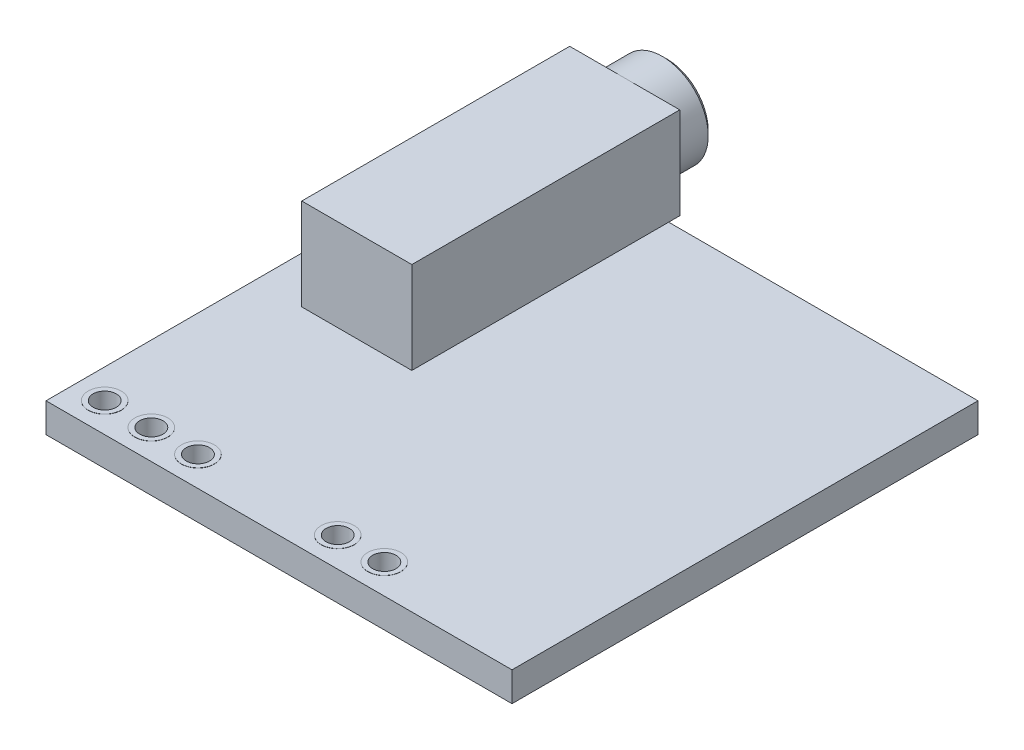
ISO-10303-21;
HEADER;
FILE_DESCRIPTION(('STEP AP214'),'2;1');
FILE_NAME('part.step','',(''),(''),'','','');
FILE_SCHEMA(('AUTOMOTIVE_DESIGN { 1 0 10303 214 1 1 1 1 }'));
ENDSEC;
DATA;
#1=APPLICATION_CONTEXT('core data for automotive mechanical design processes');
#2=APPLICATION_PROTOCOL_DEFINITION('international standard','automotive_design',2000,#1);
#3=PRODUCT_CONTEXT('',#1,'mechanical');
#4=PRODUCT('Part','Part','',(#3));
#5=PRODUCT_RELATED_PRODUCT_CATEGORY('part','',(#4));
#6=PRODUCT_DEFINITION_FORMATION('','',#4);
#7=PRODUCT_DEFINITION_CONTEXT('part definition',#1,'design');
#8=PRODUCT_DEFINITION('design','',#6,#7);
#9=PRODUCT_DEFINITION_SHAPE('','',#8);
#10=(LENGTH_UNIT() NAMED_UNIT(*) SI_UNIT(.MILLI.,.METRE.));
#11=(NAMED_UNIT(*) PLANE_ANGLE_UNIT() SI_UNIT($,.RADIAN.));
#12=(NAMED_UNIT(*) SI_UNIT($,.STERADIAN.) SOLID_ANGLE_UNIT());
#13=UNCERTAINTY_MEASURE_WITH_UNIT(LENGTH_MEASURE(1.E-05),#10,'distance_accuracy_value','');
#14=(GEOMETRIC_REPRESENTATION_CONTEXT(3) GLOBAL_UNCERTAINTY_ASSIGNED_CONTEXT((#13)) GLOBAL_UNIT_ASSIGNED_CONTEXT((#10,
#11,#12)) REPRESENTATION_CONTEXT('',''));
#15=CARTESIAN_POINT('',(0.,0.,0.));
#16=DIRECTION('',(0.,0.,1.));
#17=DIRECTION('',(1.,0.,0.));
#18=AXIS2_PLACEMENT_3D('',#15,#16,#17);
#19=CARTESIAN_POINT('',(-12.7,0.8001,12.7));
#20=DIRECTION('',(0.,1.,0.));
#21=DIRECTION('',(0.,0.,1.));
#22=AXIS2_PLACEMENT_3D('',#19,#20,#21);
#23=PLANE('',#22);
#24=CARTESIAN_POINT('',(1.6002,0.8001,11.0998));
#25=DIRECTION('',(0.,1.,0.));
#26=DIRECTION('',(0.,0.,1.));
#27=AXIS2_PLACEMENT_3D('',#24,#25,#26);
#28=CIRCLE('',#27,0.9);
#29=CARTESIAN_POINT('',(1.6002,0.8001,11.9998));
#30=VERTEX_POINT('',#29);
#31=EDGE_CURVE('E298',#30,#30,#28,.T.);
#32=ORIENTED_EDGE('',*,*,#31,.F.);
#33=EDGE_LOOP('',(#32));
#34=FACE_BOUND('',#33,.T.);
#35=CARTESIAN_POINT('',(-8.5598,0.8001,11.0998));
#36=DIRECTION('',(0.,1.,0.));
#37=DIRECTION('',(0.,0.,1.));
#38=AXIS2_PLACEMENT_3D('',#35,#36,#37);
#39=CIRCLE('',#38,0.899999999999999);
#40=CARTESIAN_POINT('',(-8.5598,0.8001,11.9998));
#41=VERTEX_POINT('',#40);
#42=EDGE_CURVE('E316',#41,#41,#39,.T.);
#43=ORIENTED_EDGE('',*,*,#42,.F.);
#44=EDGE_LOOP('',(#43));
#45=FACE_BOUND('',#44,.T.);
#46=DIRECTION('',(0.,0.,1.));
#47=VECTOR('',#46,1.);
#48=CARTESIAN_POINT('',(-10.16,0.8001,-0.302499999999999));
#49=LINE('',#48,#47);
#50=CARTESIAN_POINT('',(-10.16,0.8001,-12.7));
#51=VERTEX_POINT('',#50);
#52=CARTESIAN_POINT('',(-10.16,0.8001,1.3));
#53=VERTEX_POINT('',#52);
#54=EDGE_CURVE('E142',#51,#53,#49,.T.);
#55=ORIENTED_EDGE('',*,*,#54,.F.);
#56=DIRECTION('',(-1.,0.,0.));
#57=VECTOR('',#56,1.);
#58=CARTESIAN_POINT('',(-12.7,0.8001,-12.7));
#59=LINE('',#58,#57);
#60=CARTESIAN_POINT('',(-12.7,0.8001,-12.7));
#61=VERTEX_POINT('',#60);
#62=EDGE_CURVE('E177',#51,#61,#59,.T.);
#63=ORIENTED_EDGE('',*,*,#62,.T.);
#64=DIRECTION('',(0.,0.,1.));
#65=VECTOR('',#64,1.);
#66=CARTESIAN_POINT('',(-12.7,0.8001,-12.7));
#67=LINE('',#66,#65);
#68=CARTESIAN_POINT('',(-12.7,0.8001,12.7));
#69=VERTEX_POINT('',#68);
#70=EDGE_CURVE('E169',#61,#69,#67,.T.);
#71=ORIENTED_EDGE('',*,*,#70,.T.);
#72=DIRECTION('',(1.,0.,0.));
#73=VECTOR('',#72,1.);
#74=CARTESIAN_POINT('',(-12.7,0.8001,12.7));
#75=LINE('',#74,#73);
#76=CARTESIAN_POINT('',(12.7,0.8001,12.7));
#77=VERTEX_POINT('',#76);
#78=EDGE_CURVE('E172',#69,#77,#75,.T.);
#79=ORIENTED_EDGE('',*,*,#78,.T.);
#80=DIRECTION('',(0.,0.,-1.));
#81=VECTOR('',#80,1.);
#82=CARTESIAN_POINT('',(12.7,0.8001,-12.7));
#83=LINE('',#82,#81);
#84=CARTESIAN_POINT('',(12.7,0.8001,-12.7));
#85=VERTEX_POINT('',#84);
#86=EDGE_CURVE('E175',#77,#85,#83,.T.);
#87=ORIENTED_EDGE('',*,*,#86,.T.);
#88=CARTESIAN_POINT('',(-4.16,0.8001,-12.7));
#89=VERTEX_POINT('',#88);
#90=EDGE_CURVE('E178',#85,#89,#59,.T.);
#91=ORIENTED_EDGE('',*,*,#90,.T.);
#92=DIRECTION('',(0.,0.,1.));
#93=VECTOR('',#92,1.);
#94=CARTESIAN_POINT('',(-4.16,0.8001,-0.3025));
#95=LINE('',#94,#93);
#96=CARTESIAN_POINT('',(-4.16,0.8001,1.29999999999999));
#97=VERTEX_POINT('',#96);
#98=EDGE_CURVE('E144',#89,#97,#95,.T.);
#99=ORIENTED_EDGE('',*,*,#98,.T.);
#100=DIRECTION('',(1.,0.,0.));
#101=VECTOR('',#100,1.);
#102=CARTESIAN_POINT('',(-28.4161294029175,0.8001,1.3));
#103=LINE('',#102,#101);
#104=EDGE_CURVE('E61',#53,#97,#103,.T.);
#105=ORIENTED_EDGE('',*,*,#104,.F.);
#106=EDGE_LOOP('',(#55,#63,#71,#79,#87,#91,#99,#105));
#107=FACE_BOUND('',#106,.T.);
#108=CARTESIAN_POINT('',(-11.0998,0.8001,11.0998));
#109=DIRECTION('',(0.,1.,0.));
#110=DIRECTION('',(0.,0.,1.));
#111=AXIS2_PLACEMENT_3D('',#108,#109,#110);
#112=CIRCLE('',#111,0.9);
#113=CARTESIAN_POINT('',(-11.0998,0.8001,11.9998));
#114=VERTEX_POINT('',#113);
#115=EDGE_CURVE('E325',#114,#114,#112,.T.);
#116=ORIENTED_EDGE('',*,*,#115,.F.);
#117=EDGE_LOOP('',(#116));
#118=FACE_BOUND('',#117,.T.);
#119=CARTESIAN_POINT('',(-6.0198,0.8001,11.0998));
#120=DIRECTION('',(0.,1.,0.));
#121=DIRECTION('',(0.,0.,1.));
#122=AXIS2_PLACEMENT_3D('',#119,#120,#121);
#123=CIRCLE('',#122,0.899999999999999);
#124=CARTESIAN_POINT('',(-6.0198,0.8001,11.9998));
#125=VERTEX_POINT('',#124);
#126=EDGE_CURVE('E307',#125,#125,#123,.T.);
#127=ORIENTED_EDGE('',*,*,#126,.F.);
#128=EDGE_LOOP('',(#127));
#129=FACE_BOUND('',#128,.T.);
#130=CARTESIAN_POINT('',(4.1402,0.8001,11.0998));
#131=DIRECTION('',(0.,1.,0.));
#132=DIRECTION('',(0.,0.,1.));
#133=AXIS2_PLACEMENT_3D('',#130,#131,#132);
#134=CIRCLE('',#133,0.899999999999999);
#135=CARTESIAN_POINT('',(4.1402,0.8001,11.9998));
#136=VERTEX_POINT('',#135);
#137=EDGE_CURVE('E295',#136,#136,#134,.T.);
#138=ORIENTED_EDGE('',*,*,#137,.F.);
#139=EDGE_LOOP('',(#138));
#140=FACE_BOUND('',#139,.T.);
#141=ADVANCED_FACE('F38',(#34,#45,#107,#118,#129,#140),#23,.T.);
#142=CARTESIAN_POINT('',(-28.4161294029175,5.8001,-13.305));
#143=DIRECTION('',(0.,0.,-1.));
#144=DIRECTION('',(-1.,0.,0.));
#145=AXIS2_PLACEMENT_3D('',#142,#143,#144);
#146=PLANE('',#145);
#147=CARTESIAN_POINT('',(-7.16,3.3001,-13.305));
#148=DIRECTION('',(0.,0.,-1.));
#149=DIRECTION('',(-1.,0.,0.));
#150=AXIS2_PLACEMENT_3D('',#147,#148,#149);
#151=CIRCLE('',#150,2.5);
#152=CARTESIAN_POINT('',(-7.16,5.8001,-13.305));
#153=VERTEX_POINT('',#152);
#154=CARTESIAN_POINT('',(-7.16,0.8001,-13.305));
#155=VERTEX_POINT('',#154);
#156=EDGE_CURVE('E134',#153,#155,#151,.T.);
#157=ORIENTED_EDGE('',*,*,#156,.F.);
#158=DIRECTION('',(1.,0.,0.));
#159=VECTOR('',#158,1.);
#160=CARTESIAN_POINT('',(-28.4161294029175,5.8001,-13.305));
#161=LINE('',#160,#159);
#162=CARTESIAN_POINT('',(-4.16,5.8001,-13.305));
#163=VERTEX_POINT('',#162);
#164=EDGE_CURVE('E123',#153,#163,#161,.T.);
#165=ORIENTED_EDGE('',*,*,#164,.T.);
#166=DIRECTION('',(0.,-1.,0.));
#167=VECTOR('',#166,1.);
#168=CARTESIAN_POINT('',(-4.16,5.8001,-13.305));
#169=LINE('',#168,#167);
#170=CARTESIAN_POINT('',(-4.16,0.8001,-13.305));
#171=VERTEX_POINT('',#170);
#172=EDGE_CURVE('E164',#163,#171,#169,.T.);
#173=ORIENTED_EDGE('',*,*,#172,.T.);
#174=DIRECTION('',(1.,0.,0.));
#175=VECTOR('',#174,1.);
#176=CARTESIAN_POINT('',(-28.4161294029175,0.8001,-13.305));
#177=LINE('',#176,#175);
#178=EDGE_CURVE('E136',#155,#171,#177,.T.);
#179=ORIENTED_EDGE('',*,*,#178,.F.);
#180=EDGE_LOOP('',(#157,#165,#173,#179));
#181=FACE_BOUND('',#180,.T.);
#182=ADVANCED_FACE('F135',(#181),#146,.T.);
#183=CARTESIAN_POINT('',(-12.7,0.8001,-12.7));
#184=DIRECTION('',(1.,0.,0.));
#185=DIRECTION('',(0.,0.,-1.));
#186=AXIS2_PLACEMENT_3D('',#183,#184,#185);
#187=PLANE('',#186);
#188=DIRECTION('',(0.,0.,1.));
#189=VECTOR('',#188,1.);
#190=CARTESIAN_POINT('',(-12.7,-0.8001,-12.7));
#191=LINE('',#190,#189);
#192=CARTESIAN_POINT('',(-12.7,-0.8001,-12.7));
#193=VERTEX_POINT('',#192);
#194=CARTESIAN_POINT('',(-12.7,-0.8001,12.7));
#195=VERTEX_POINT('',#194);
#196=EDGE_CURVE('E168',#193,#195,#191,.T.);
#197=ORIENTED_EDGE('',*,*,#196,.T.);
#198=DIRECTION('',(0.,-1.,0.));
#199=VECTOR('',#198,1.);
#200=CARTESIAN_POINT('',(-12.7,0.8001,12.7));
#201=LINE('',#200,#199);
#202=EDGE_CURVE('E198',#69,#195,#201,.T.);
#203=ORIENTED_EDGE('',*,*,#202,.F.);
#204=ORIENTED_EDGE('',*,*,#70,.F.);
#205=DIRECTION('',(0.,-1.,0.));
#206=VECTOR('',#205,1.);
#207=CARTESIAN_POINT('',(-12.7,0.8001,-12.7));
#208=LINE('',#207,#206);
#209=EDGE_CURVE('E181',#61,#193,#208,.T.);
#210=ORIENTED_EDGE('',*,*,#209,.T.);
#211=EDGE_LOOP('',(#197,#203,#204,#210));
#212=FACE_BOUND('',#211,.T.);
#213=ADVANCED_FACE('F222',(#212),#187,.F.);
#214=CARTESIAN_POINT('',(-12.7,0.8001,12.7));
#215=DIRECTION('',(0.,0.,-1.));
#216=DIRECTION('',(-1.,0.,0.));
#217=AXIS2_PLACEMENT_3D('',#214,#215,#216);
#218=PLANE('',#217);
#219=DIRECTION('',(1.,0.,0.));
#220=VECTOR('',#219,1.);
#221=CARTESIAN_POINT('',(-12.7,-0.8001,12.7));
#222=LINE('',#221,#220);
#223=CARTESIAN_POINT('',(12.7,-0.8001,12.7));
#224=VERTEX_POINT('',#223);
#225=EDGE_CURVE('E185',#195,#224,#222,.T.);
#226=ORIENTED_EDGE('',*,*,#225,.T.);
#227=DIRECTION('',(0.,-1.,0.));
#228=VECTOR('',#227,1.);
#229=CARTESIAN_POINT('',(12.7,0.8001,12.7));
#230=LINE('',#229,#228);
#231=EDGE_CURVE('E195',#77,#224,#230,.T.);
#232=ORIENTED_EDGE('',*,*,#231,.F.);
#233=ORIENTED_EDGE('',*,*,#78,.F.);
#234=ORIENTED_EDGE('',*,*,#202,.T.);
#235=EDGE_LOOP('',(#226,#232,#233,#234));
#236=FACE_BOUND('',#235,.T.);
#237=ADVANCED_FACE('F227',(#236),#218,.F.);
#238=CARTESIAN_POINT('',(12.7,0.8001,-12.7));
#239=DIRECTION('',(-1.,0.,0.));
#240=DIRECTION('',(0.,0.,1.));
#241=AXIS2_PLACEMENT_3D('',#238,#239,#240);
#242=PLANE('',#241);
#243=DIRECTION('',(0.,0.,-1.));
#244=VECTOR('',#243,1.);
#245=CARTESIAN_POINT('',(12.7,-0.8001,-12.7));
#246=LINE('',#245,#244);
#247=CARTESIAN_POINT('',(12.7,-0.8001,-12.7));
#248=VERTEX_POINT('',#247);
#249=EDGE_CURVE('E187',#224,#248,#246,.T.);
#250=ORIENTED_EDGE('',*,*,#249,.T.);
#251=DIRECTION('',(0.,-1.,0.));
#252=VECTOR('',#251,1.);
#253=CARTESIAN_POINT('',(12.7,0.8001,-12.7));
#254=LINE('',#253,#252);
#255=EDGE_CURVE('E192',#85,#248,#254,.T.);
#256=ORIENTED_EDGE('',*,*,#255,.F.);
#257=ORIENTED_EDGE('',*,*,#86,.F.);
#258=ORIENTED_EDGE('',*,*,#231,.T.);
#259=EDGE_LOOP('',(#250,#256,#257,#258));
#260=FACE_BOUND('',#259,.T.);
#261=ADVANCED_FACE('F230',(#260),#242,.F.);
#262=CARTESIAN_POINT('',(-12.7,0.8001,-12.7));
#263=DIRECTION('',(0.,0.,1.));
#264=DIRECTION('',(1.,0.,0.));
#265=AXIS2_PLACEMENT_3D('',#262,#263,#264);
#266=PLANE('',#265);
#267=DIRECTION('',(-1.,0.,0.));
#268=VECTOR('',#267,1.);
#269=CARTESIAN_POINT('',(-12.7,-0.8001,-12.7));
#270=LINE('',#269,#268);
#271=EDGE_CURVE('E173',#248,#193,#270,.T.);
#272=ORIENTED_EDGE('',*,*,#271,.T.);
#273=ORIENTED_EDGE('',*,*,#209,.F.);
#274=ORIENTED_EDGE('',*,*,#62,.F.);
#275=EDGE_CURVE('E182',#89,#51,#59,.T.);
#276=ORIENTED_EDGE('',*,*,#275,.F.);
#277=ORIENTED_EDGE('',*,*,#90,.F.);
#278=ORIENTED_EDGE('',*,*,#255,.T.);
#279=EDGE_LOOP('',(#272,#273,#274,#276,#277,#278));
#280=FACE_BOUND('',#279,.T.);
#281=ADVANCED_FACE('F216',(#280),#266,.F.);
#282=CARTESIAN_POINT('',(-12.7,-0.8001,12.7));
#283=DIRECTION('',(0.,1.,0.));
#284=DIRECTION('',(0.,0.,1.));
#285=AXIS2_PLACEMENT_3D('',#282,#283,#284);
#286=PLANE('',#285);
#287=CARTESIAN_POINT('',(4.1402,-0.8001,11.0998));
#288=DIRECTION('',(0.,1.,0.));
#289=DIRECTION('',(0.,0.,1.));
#290=AXIS2_PLACEMENT_3D('',#287,#288,#289);
#291=CIRCLE('',#290,0.899999999999999);
#292=CARTESIAN_POINT('',(4.1402,-0.8001,11.9998));
#293=VERTEX_POINT('',#292);
#294=EDGE_CURVE('E263',#293,#293,#291,.T.);
#295=ORIENTED_EDGE('',*,*,#294,.T.);
#296=EDGE_LOOP('',(#295));
#297=FACE_BOUND('',#296,.T.);
#298=CARTESIAN_POINT('',(1.6002,-0.8001,11.0998));
#299=DIRECTION('',(0.,1.,0.));
#300=DIRECTION('',(0.,0.,1.));
#301=AXIS2_PLACEMENT_3D('',#298,#299,#300);
#302=CIRCLE('',#301,0.9);
#303=CARTESIAN_POINT('',(1.6002,-0.8001,11.9998));
#304=VERTEX_POINT('',#303);
#305=EDGE_CURVE('E267',#304,#304,#302,.T.);
#306=ORIENTED_EDGE('',*,*,#305,.T.);
#307=EDGE_LOOP('',(#306));
#308=FACE_BOUND('',#307,.T.);
#309=CARTESIAN_POINT('',(-6.0198,-0.8001,11.0998));
#310=DIRECTION('',(0.,1.,0.));
#311=DIRECTION('',(0.,0.,1.));
#312=AXIS2_PLACEMENT_3D('',#309,#310,#311);
#313=CIRCLE('',#312,0.899999999999999);
#314=CARTESIAN_POINT('',(-6.0198,-0.8001,11.9998));
#315=VERTEX_POINT('',#314);
#316=EDGE_CURVE('E271',#315,#315,#313,.T.);
#317=ORIENTED_EDGE('',*,*,#316,.T.);
#318=EDGE_LOOP('',(#317));
#319=FACE_BOUND('',#318,.T.);
#320=CARTESIAN_POINT('',(-8.5598,-0.8001,11.0998));
#321=DIRECTION('',(0.,1.,0.));
#322=DIRECTION('',(0.,0.,1.));
#323=AXIS2_PLACEMENT_3D('',#320,#321,#322);
#324=CIRCLE('',#323,0.899999999999999);
#325=CARTESIAN_POINT('',(-8.5598,-0.8001,11.9998));
#326=VERTEX_POINT('',#325);
#327=EDGE_CURVE('E275',#326,#326,#324,.T.);
#328=ORIENTED_EDGE('',*,*,#327,.T.);
#329=EDGE_LOOP('',(#328));
#330=FACE_BOUND('',#329,.T.);
#331=CARTESIAN_POINT('',(-11.0998,-0.8001,11.0998));
#332=DIRECTION('',(0.,1.,0.));
#333=DIRECTION('',(0.,0.,1.));
#334=AXIS2_PLACEMENT_3D('',#331,#332,#333);
#335=CIRCLE('',#334,0.9);
#336=CARTESIAN_POINT('',(-11.0998,-0.8001,11.9998));
#337=VERTEX_POINT('',#336);
#338=EDGE_CURVE('E278',#337,#337,#335,.T.);
#339=ORIENTED_EDGE('',*,*,#338,.T.);
#340=EDGE_LOOP('',(#339));
#341=FACE_BOUND('',#340,.T.);
#342=ORIENTED_EDGE('',*,*,#196,.F.);
#343=ORIENTED_EDGE('',*,*,#271,.F.);
#344=ORIENTED_EDGE('',*,*,#249,.F.);
#345=ORIENTED_EDGE('',*,*,#225,.F.);
#346=EDGE_LOOP('',(#342,#343,#344,#345));
#347=FACE_BOUND('',#346,.T.);
#348=ADVANCED_FACE('F224',(#297,#308,#319,#330,#341,#347),#286,.F.);
#349=CARTESIAN_POINT('',(-11.0998,-0.8001,11.0998));
#350=DIRECTION('',(0.,1.,0.));
#351=DIRECTION('',(0.,0.,1.));
#352=AXIS2_PLACEMENT_3D('',#349,#350,#351);
#353=CYLINDRICAL_SURFACE('',#352,0.635000000000001);
#354=CARTESIAN_POINT('',(-11.0998,0.8101,11.0998));
#355=DIRECTION('',(0.,1.,0.));
#356=DIRECTION('',(0.,0.,1.));
#357=AXIS2_PLACEMENT_3D('',#354,#355,#356);
#358=CIRCLE('',#357,0.635000000000001);
#359=CARTESIAN_POINT('',(-11.0998,0.8101,11.7348));
#360=VERTEX_POINT('',#359);
#361=EDGE_CURVE('E328',#360,#360,#358,.F.);
#362=ORIENTED_EDGE('',*,*,#361,.F.);
#363=EDGE_LOOP('',(#362));
#364=FACE_BOUND('',#363,.T.);
#365=CARTESIAN_POINT('',(-11.0998,-0.8101,11.0998));
#366=DIRECTION('',(0.,1.,0.));
#367=DIRECTION('',(0.,0.,1.));
#368=AXIS2_PLACEMENT_3D('',#365,#366,#367);
#369=CIRCLE('',#368,0.635000000000001);
#370=CARTESIAN_POINT('',(-11.0998,-0.8101,11.7348));
#371=VERTEX_POINT('',#370);
#372=EDGE_CURVE('E280',#371,#371,#369,.F.);
#373=ORIENTED_EDGE('',*,*,#372,.T.);
#374=EDGE_LOOP('',(#373));
#375=FACE_BOUND('',#374,.T.);
#376=ADVANCED_FACE('F251',(#364,#375),#353,.F.);
#377=CARTESIAN_POINT('',(-8.5598,-0.8001,11.0998));
#378=DIRECTION('',(0.,1.,0.));
#379=DIRECTION('',(0.,0.,1.));
#380=AXIS2_PLACEMENT_3D('',#377,#378,#379);
#381=CYLINDRICAL_SURFACE('',#380,0.635000000000001);
#382=CARTESIAN_POINT('',(-8.5598,0.8101,11.0998));
#383=DIRECTION('',(0.,1.,0.));
#384=DIRECTION('',(0.,0.,1.));
#385=AXIS2_PLACEMENT_3D('',#382,#383,#384);
#386=CIRCLE('',#385,0.635000000000001);
#387=CARTESIAN_POINT('',(-8.5598,0.8101,11.7348));
#388=VERTEX_POINT('',#387);
#389=EDGE_CURVE('E319',#388,#388,#386,.F.);
#390=ORIENTED_EDGE('',*,*,#389,.F.);
#391=EDGE_LOOP('',(#390));
#392=FACE_BOUND('',#391,.T.);
#393=CARTESIAN_POINT('',(-8.5598,-0.8101,11.0998));
#394=DIRECTION('',(0.,1.,0.));
#395=DIRECTION('',(0.,0.,1.));
#396=AXIS2_PLACEMENT_3D('',#393,#394,#395);
#397=CIRCLE('',#396,0.635000000000001);
#398=CARTESIAN_POINT('',(-8.5598,-0.8101,11.7348));
#399=VERTEX_POINT('',#398);
#400=EDGE_CURVE('E287',#399,#399,#397,.F.);
#401=ORIENTED_EDGE('',*,*,#400,.T.);
#402=EDGE_LOOP('',(#401));
#403=FACE_BOUND('',#402,.T.);
#404=ADVANCED_FACE('F258',(#392,#403),#381,.F.);
#405=CARTESIAN_POINT('',(-6.0198,-0.8001,11.0998));
#406=DIRECTION('',(0.,1.,0.));
#407=DIRECTION('',(0.,0.,1.));
#408=AXIS2_PLACEMENT_3D('',#405,#406,#407);
#409=CYLINDRICAL_SURFACE('',#408,0.635000000000001);
#410=CARTESIAN_POINT('',(-6.0198,0.8101,11.0998));
#411=DIRECTION('',(0.,1.,0.));
#412=DIRECTION('',(0.,0.,1.));
#413=AXIS2_PLACEMENT_3D('',#410,#411,#412);
#414=CIRCLE('',#413,0.635000000000001);
#415=CARTESIAN_POINT('',(-6.0198,0.8101,11.7348));
#416=VERTEX_POINT('',#415);
#417=EDGE_CURVE('E310',#416,#416,#414,.F.);
#418=ORIENTED_EDGE('',*,*,#417,.F.);
#419=EDGE_LOOP('',(#418));
#420=FACE_BOUND('',#419,.T.);
#421=CARTESIAN_POINT('',(-6.0198,-0.8101,11.0998));
#422=DIRECTION('',(0.,1.,0.));
#423=DIRECTION('',(0.,0.,1.));
#424=AXIS2_PLACEMENT_3D('',#421,#422,#423);
#425=CIRCLE('',#424,0.635000000000001);
#426=CARTESIAN_POINT('',(-6.0198,-0.8101,11.7348));
#427=VERTEX_POINT('',#426);
#428=EDGE_CURVE('E403',#427,#427,#425,.F.);
#429=ORIENTED_EDGE('',*,*,#428,.T.);
#430=EDGE_LOOP('',(#429));
#431=FACE_BOUND('',#430,.T.);
#432=ADVANCED_FACE('F385',(#420,#431),#409,.F.);
#433=CARTESIAN_POINT('',(1.6002,-0.8001,11.0998));
#434=DIRECTION('',(0.,1.,0.));
#435=DIRECTION('',(0.,0.,1.));
#436=AXIS2_PLACEMENT_3D('',#433,#434,#435);
#437=CYLINDRICAL_SURFACE('',#436,0.635);
#438=CARTESIAN_POINT('',(1.6002,0.8101,11.0998));
#439=DIRECTION('',(0.,1.,0.));
#440=DIRECTION('',(0.,0.,1.));
#441=AXIS2_PLACEMENT_3D('',#438,#439,#440);
#442=CIRCLE('',#441,0.635);
#443=CARTESIAN_POINT('',(1.6002,0.8101,11.7348));
#444=VERTEX_POINT('',#443);
#445=EDGE_CURVE('E301',#444,#444,#442,.F.);
#446=ORIENTED_EDGE('',*,*,#445,.F.);
#447=EDGE_LOOP('',(#446));
#448=FACE_BOUND('',#447,.T.);
#449=CARTESIAN_POINT('',(1.6002,-0.8101,11.0998));
#450=DIRECTION('',(0.,1.,0.));
#451=DIRECTION('',(0.,0.,1.));
#452=AXIS2_PLACEMENT_3D('',#449,#450,#451);
#453=CIRCLE('',#452,0.635);
#454=CARTESIAN_POINT('',(1.6002,-0.8101,11.7348));
#455=VERTEX_POINT('',#454);
#456=EDGE_CURVE('E410',#455,#455,#453,.F.);
#457=ORIENTED_EDGE('',*,*,#456,.T.);
#458=EDGE_LOOP('',(#457));
#459=FACE_BOUND('',#458,.T.);
#460=ADVANCED_FACE('F381',(#448,#459),#437,.F.);
#461=CARTESIAN_POINT('',(4.1402,-0.8001,11.0998));
#462=DIRECTION('',(0.,1.,0.));
#463=DIRECTION('',(0.,0.,1.));
#464=AXIS2_PLACEMENT_3D('',#461,#462,#463);
#465=CYLINDRICAL_SURFACE('',#464,0.635000000000001);
#466=CARTESIAN_POINT('',(4.1402,0.8101,11.0998));
#467=DIRECTION('',(0.,1.,0.));
#468=DIRECTION('',(0.,0.,1.));
#469=AXIS2_PLACEMENT_3D('',#466,#467,#468);
#470=CIRCLE('',#469,0.635000000000001);
#471=CARTESIAN_POINT('',(4.1402,0.8101,11.7348));
#472=VERTEX_POINT('',#471);
#473=EDGE_CURVE('E291',#472,#472,#470,.F.);
#474=ORIENTED_EDGE('',*,*,#473,.F.);
#475=EDGE_LOOP('',(#474));
#476=FACE_BOUND('',#475,.T.);
#477=CARTESIAN_POINT('',(4.1402,-0.8101,11.0998));
#478=DIRECTION('',(0.,1.,0.));
#479=DIRECTION('',(0.,0.,1.));
#480=AXIS2_PLACEMENT_3D('',#477,#478,#479);
#481=CIRCLE('',#480,0.635000000000001);
#482=CARTESIAN_POINT('',(4.1402,-0.8101,11.7348));
#483=VERTEX_POINT('',#482);
#484=EDGE_CURVE('E417',#483,#483,#481,.F.);
#485=ORIENTED_EDGE('',*,*,#484,.T.);
#486=EDGE_LOOP('',(#485));
#487=FACE_BOUND('',#486,.T.);
#488=ADVANCED_FACE('F370',(#476,#487),#465,.F.);
#489=CARTESIAN_POINT('',(-28.4161294029175,0.8001,-0.302499999999997));
#490=DIRECTION('',(0.,1.,0.));
#491=DIRECTION('',(0.,0.,1.));
#492=AXIS2_PLACEMENT_3D('',#489,#490,#491);
#493=PLANE('',#492);
#494=EDGE_CURVE('E156',#171,#89,#95,.T.);
#495=ORIENTED_EDGE('',*,*,#494,.T.);
#496=ORIENTED_EDGE('',*,*,#275,.T.);
#497=CARTESIAN_POINT('',(-10.16,0.8001,-13.305));
#498=VERTEX_POINT('',#497);
#499=EDGE_CURVE('E146',#498,#51,#49,.T.);
#500=ORIENTED_EDGE('',*,*,#499,.F.);
#501=EDGE_CURVE('E159',#498,#155,#177,.T.);
#502=ORIENTED_EDGE('',*,*,#501,.T.);
#503=ORIENTED_EDGE('',*,*,#178,.T.);
#504=EDGE_LOOP('',(#495,#496,#500,#502,#503));
#505=FACE_BOUND('',#504,.T.);
#506=ADVANCED_FACE('F212',(#505),#493,.F.);
#507=CARTESIAN_POINT('',(-28.4161294029175,5.8001,1.3));
#508=DIRECTION('',(0.,0.,-1.));
#509=DIRECTION('',(-1.,0.,0.));
#510=AXIS2_PLACEMENT_3D('',#507,#508,#509);
#511=PLANE('',#510);
#512=ORIENTED_EDGE('',*,*,#104,.T.);
#513=DIRECTION('',(0.,-1.,0.));
#514=VECTOR('',#513,1.);
#515=CARTESIAN_POINT('',(-4.16,5.8001,1.29999999999999));
#516=LINE('',#515,#514);
#517=CARTESIAN_POINT('',(-4.16,5.8001,1.29999999999999));
#518=VERTEX_POINT('',#517);
#519=EDGE_CURVE('E166',#518,#97,#516,.T.);
#520=ORIENTED_EDGE('',*,*,#519,.F.);
#521=DIRECTION('',(1.,0.,0.));
#522=VECTOR('',#521,1.);
#523=CARTESIAN_POINT('',(-28.4161294029175,5.8001,1.3));
#524=LINE('',#523,#522);
#525=CARTESIAN_POINT('',(-10.16,5.8001,1.3));
#526=VERTEX_POINT('',#525);
#527=EDGE_CURVE('E150',#526,#518,#524,.T.);
#528=ORIENTED_EDGE('',*,*,#527,.F.);
#529=DIRECTION('',(0.,-1.,0.));
#530=VECTOR('',#529,1.);
#531=CARTESIAN_POINT('',(-10.16,5.8001,1.3));
#532=LINE('',#531,#530);
#533=EDGE_CURVE('E154',#526,#53,#532,.T.);
#534=ORIENTED_EDGE('',*,*,#533,.T.);
#535=EDGE_LOOP('',(#512,#520,#528,#534));
#536=FACE_BOUND('',#535,.T.);
#537=ADVANCED_FACE('F369',(#536),#511,.F.);
#538=CARTESIAN_POINT('',(-4.16,5.8001,-0.3025));
#539=DIRECTION('',(1.,0.,0.));
#540=DIRECTION('',(0.,0.,-1.));
#541=AXIS2_PLACEMENT_3D('',#538,#539,#540);
#542=PLANE('',#541);
#543=ORIENTED_EDGE('',*,*,#494,.F.);
#544=ORIENTED_EDGE('',*,*,#172,.F.);
#545=DIRECTION('',(0.,0.,1.));
#546=VECTOR('',#545,1.);
#547=CARTESIAN_POINT('',(-4.16,5.8001,-0.3025));
#548=LINE('',#547,#546);
#549=EDGE_CURVE('E129',#163,#518,#548,.T.);
#550=ORIENTED_EDGE('',*,*,#549,.T.);
#551=ORIENTED_EDGE('',*,*,#519,.T.);
#552=ORIENTED_EDGE('',*,*,#98,.F.);
#553=EDGE_LOOP('',(#543,#544,#550,#551,#552));
#554=FACE_BOUND('',#553,.T.);
#555=ADVANCED_FACE('F209',(#554),#542,.T.);
#556=EDGE_CURVE('E53',#155,#153,#151,.T.);
#557=ORIENTED_EDGE('',*,*,#556,.F.);
#558=ORIENTED_EDGE('',*,*,#501,.F.);
#559=DIRECTION('',(0.,-1.,0.));
#560=VECTOR('',#559,1.);
#561=CARTESIAN_POINT('',(-10.16,5.8001,-13.305));
#562=LINE('',#561,#560);
#563=CARTESIAN_POINT('',(-10.16,5.8001,-13.305));
#564=VERTEX_POINT('',#563);
#565=EDGE_CURVE('E119',#564,#498,#562,.T.);
#566=ORIENTED_EDGE('',*,*,#565,.F.);
#567=EDGE_CURVE('E116',#564,#153,#161,.T.);
#568=ORIENTED_EDGE('',*,*,#567,.T.);
#569=EDGE_LOOP('',(#557,#558,#566,#568));
#570=FACE_BOUND('',#569,.T.);
#571=ADVANCED_FACE('F118',(#570),#146,.T.);
#572=CARTESIAN_POINT('',(-10.16,5.8001,-0.302499999999999));
#573=DIRECTION('',(1.,0.,0.));
#574=DIRECTION('',(0.,0.,-1.));
#575=AXIS2_PLACEMENT_3D('',#572,#573,#574);
#576=PLANE('',#575);
#577=ORIENTED_EDGE('',*,*,#499,.T.);
#578=ORIENTED_EDGE('',*,*,#54,.T.);
#579=ORIENTED_EDGE('',*,*,#533,.F.);
#580=DIRECTION('',(0.,0.,1.));
#581=VECTOR('',#580,1.);
#582=CARTESIAN_POINT('',(-10.16,5.8001,-0.302499999999999));
#583=LINE('',#582,#581);
#584=EDGE_CURVE('E122',#564,#526,#583,.T.);
#585=ORIENTED_EDGE('',*,*,#584,.F.);
#586=ORIENTED_EDGE('',*,*,#565,.T.);
#587=EDGE_LOOP('',(#577,#578,#579,#585,#586));
#588=FACE_BOUND('',#587,.T.);
#589=ADVANCED_FACE('F366',(#588),#576,.F.);
#590=CARTESIAN_POINT('',(-28.4161294029175,5.8001,-0.302499999999997));
#591=DIRECTION('',(0.,1.,0.));
#592=DIRECTION('',(0.,0.,1.));
#593=AXIS2_PLACEMENT_3D('',#590,#591,#592);
#594=PLANE('',#593);
#595=ORIENTED_EDGE('',*,*,#527,.T.);
#596=ORIENTED_EDGE('',*,*,#549,.F.);
#597=ORIENTED_EDGE('',*,*,#164,.F.);
#598=ORIENTED_EDGE('',*,*,#567,.F.);
#599=ORIENTED_EDGE('',*,*,#584,.T.);
#600=EDGE_LOOP('',(#595,#596,#597,#598,#599));
#601=FACE_BOUND('',#600,.T.);
#602=ADVANCED_FACE('F127',(#601),#594,.T.);
#603=CARTESIAN_POINT('',(-7.16,3.3001,-15.605));
#604=DIRECTION('',(0.,0.,1.));
#605=DIRECTION('',(1.,0.,0.));
#606=AXIS2_PLACEMENT_3D('',#603,#604,#605);
#607=CYLINDRICAL_SURFACE('',#606,2.5);
#608=CARTESIAN_POINT('',(-7.16,3.3001,-15.355));
#609=DIRECTION('',(0.,0.,-1.));
#610=DIRECTION('',(-1.,0.,0.));
#611=AXIS2_PLACEMENT_3D('',#608,#609,#610);
#612=CIRCLE('',#611,2.5);
#613=CARTESIAN_POINT('',(-9.66,3.3001,-15.355));
#614=VERTEX_POINT('',#613);
#615=EDGE_CURVE('E12',#614,#614,#612,.F.);
#616=ORIENTED_EDGE('',*,*,#615,.T.);
#617=EDGE_LOOP('',(#616));
#618=FACE_BOUND('',#617,.T.);
#619=ORIENTED_EDGE('',*,*,#156,.T.);
#620=ORIENTED_EDGE('',*,*,#556,.T.);
#621=EDGE_LOOP('',(#619,#620));
#622=FACE_BOUND('',#621,.T.);
#623=ADVANCED_FACE('F141',(#618,#622),#607,.T.);
#624=CARTESIAN_POINT('',(-13.3763699156903,3.3001,-15.605));
#625=DIRECTION('',(0.,0.,-1.));
#626=DIRECTION('',(-1.,0.,0.));
#627=AXIS2_PLACEMENT_3D('',#624,#625,#626);
#628=PLANE('',#627);
#629=CARTESIAN_POINT('',(-7.16,3.3001,-15.605));
#630=DIRECTION('',(0.,0.,-1.));
#631=DIRECTION('',(-1.,0.,0.));
#632=AXIS2_PLACEMENT_3D('',#629,#630,#631);
#633=CIRCLE('',#632,2.24999999999999);
#634=CARTESIAN_POINT('',(-9.40999999999999,3.3001,-15.605));
#635=VERTEX_POINT('',#634);
#636=EDGE_CURVE('E46',#635,#635,#633,.T.);
#637=ORIENTED_EDGE('',*,*,#636,.T.);
#638=EDGE_LOOP('',(#637));
#639=FACE_BOUND('',#638,.T.);
#640=CARTESIAN_POINT('',(-7.16,3.3001,-15.605));
#641=DIRECTION('',(0.,0.,-1.));
#642=DIRECTION('',(-1.,0.,0.));
#643=AXIS2_PLACEMENT_3D('',#640,#641,#642);
#644=CIRCLE('',#643,1.75);
#645=CARTESIAN_POINT('',(-8.91,3.3001,-15.605));
#646=VERTEX_POINT('',#645);
#647=EDGE_CURVE('E334',#646,#646,#644,.T.);
#648=ORIENTED_EDGE('',*,*,#647,.F.);
#649=EDGE_LOOP('',(#648));
#650=FACE_BOUND('',#649,.T.);
#651=ADVANCED_FACE('F353',(#639,#650),#628,.T.);
#652=CARTESIAN_POINT('',(-7.16,3.3001,6.24974746830582));
#653=DIRECTION('',(0.,0.,-1.));
#654=DIRECTION('',(-1.,0.,0.));
#655=AXIS2_PLACEMENT_3D('',#652,#653,#654);
#656=CYLINDRICAL_SURFACE('',#655,1.75);
#657=CARTESIAN_POINT('',(-7.16,3.3001,0.299999999999995));
#658=DIRECTION('',(0.,0.,-1.));
#659=DIRECTION('',(-1.,0.,0.));
#660=AXIS2_PLACEMENT_3D('',#657,#658,#659);
#661=CIRCLE('',#660,1.75);
#662=CARTESIAN_POINT('',(-8.91,3.3001,0.299999999999995));
#663=VERTEX_POINT('',#662);
#664=EDGE_CURVE('E139',#663,#663,#661,.F.);
#665=ORIENTED_EDGE('',*,*,#664,.T.);
#666=EDGE_LOOP('',(#665));
#667=FACE_BOUND('',#666,.T.);
#668=ORIENTED_EDGE('',*,*,#647,.T.);
#669=EDGE_LOOP('',(#668));
#670=FACE_BOUND('',#669,.T.);
#671=ADVANCED_FACE('F342',(#667,#670),#656,.F.);
#672=CARTESIAN_POINT('',(-28.4161294029175,5.8001,0.299999999999998));
#673=DIRECTION('',(0.,0.,-1.));
#674=DIRECTION('',(-1.,0.,0.));
#675=AXIS2_PLACEMENT_3D('',#672,#673,#674);
#676=PLANE('',#675);
#677=ORIENTED_EDGE('',*,*,#664,.F.);
#678=EDGE_LOOP('',(#677));
#679=FACE_BOUND('',#678,.T.);
#680=ADVANCED_FACE('F344',(#679),#676,.T.);
#681=CARTESIAN_POINT('',(-7.16,3.3001,-15.605));
#682=DIRECTION('',(0.,0.,1.));
#683=DIRECTION('',(1.,0.,0.));
#684=AXIS2_PLACEMENT_3D('',#681,#682,#683);
#685=CONICAL_SURFACE('',#684,2.24999999999999,0.785398163397451);
#686=ORIENTED_EDGE('',*,*,#615,.F.);
#687=EDGE_LOOP('',(#686));
#688=FACE_BOUND('',#687,.T.);
#689=ORIENTED_EDGE('',*,*,#636,.F.);
#690=EDGE_LOOP('',(#689));
#691=FACE_BOUND('',#690,.T.);
#692=ADVANCED_FACE('F40',(#688,#691),#685,.T.);
#693=CARTESIAN_POINT('',(-11.0998,0.8101,11.0998));
#694=DIRECTION('',(0.,-1.,0.));
#695=DIRECTION('',(0.,0.,-1.));
#696=AXIS2_PLACEMENT_3D('',#693,#694,#695);
#697=CYLINDRICAL_SURFACE('',#696,0.9);
#698=CARTESIAN_POINT('',(-11.0998,0.8101,11.0998));
#699=DIRECTION('',(0.,1.,0.));
#700=DIRECTION('',(0.,0.,1.));
#701=AXIS2_PLACEMENT_3D('',#698,#699,#700);
#702=CIRCLE('',#701,0.9);
#703=CARTESIAN_POINT('',(-11.0998,0.8101,11.9998));
#704=VERTEX_POINT('',#703);
#705=EDGE_CURVE('E331',#704,#704,#702,.T.);
#706=ORIENTED_EDGE('',*,*,#705,.F.);
#707=EDGE_LOOP('',(#706));
#708=FACE_BOUND('',#707,.T.);
#709=ORIENTED_EDGE('',*,*,#115,.T.);
#710=EDGE_LOOP('',(#709));
#711=FACE_BOUND('',#710,.T.);
#712=ADVANCED_FACE('F351',(#708,#711),#697,.T.);
#713=CARTESIAN_POINT('',(-28.0814213562373,0.8101,0.));
#714=DIRECTION('',(0.,1.,0.));
#715=DIRECTION('',(0.,0.,1.));
#716=AXIS2_PLACEMENT_3D('',#713,#714,#715);
#717=PLANE('',#716);
#718=ORIENTED_EDGE('',*,*,#361,.T.);
#719=EDGE_LOOP('',(#718));
#720=FACE_BOUND('',#719,.T.);
#721=ORIENTED_EDGE('',*,*,#705,.T.);
#722=EDGE_LOOP('',(#721));
#723=FACE_BOUND('',#722,.T.);
#724=ADVANCED_FACE('F498',(#720,#723),#717,.T.);
#725=CARTESIAN_POINT('',(-8.5598,0.8101,11.0998));
#726=DIRECTION('',(0.,-1.,0.));
#727=DIRECTION('',(0.,0.,-1.));
#728=AXIS2_PLACEMENT_3D('',#725,#726,#727);
#729=CYLINDRICAL_SURFACE('',#728,0.899999999999999);
#730=CARTESIAN_POINT('',(-8.5598,0.8101,11.0998));
#731=DIRECTION('',(0.,1.,0.));
#732=DIRECTION('',(0.,0.,1.));
#733=AXIS2_PLACEMENT_3D('',#730,#731,#732);
#734=CIRCLE('',#733,0.899999999999999);
#735=CARTESIAN_POINT('',(-8.5598,0.8101,11.9998));
#736=VERTEX_POINT('',#735);
#737=EDGE_CURVE('E322',#736,#736,#734,.T.);
#738=ORIENTED_EDGE('',*,*,#737,.F.);
#739=EDGE_LOOP('',(#738));
#740=FACE_BOUND('',#739,.T.);
#741=ORIENTED_EDGE('',*,*,#42,.T.);
#742=EDGE_LOOP('',(#741));
#743=FACE_BOUND('',#742,.T.);
#744=ADVANCED_FACE('F495',(#740,#743),#729,.T.);
#745=CARTESIAN_POINT('',(-28.0814213562373,0.8101,0.));
#746=DIRECTION('',(0.,1.,0.));
#747=DIRECTION('',(0.,0.,1.));
#748=AXIS2_PLACEMENT_3D('',#745,#746,#747);
#749=PLANE('',#748);
#750=ORIENTED_EDGE('',*,*,#389,.T.);
#751=EDGE_LOOP('',(#750));
#752=FACE_BOUND('',#751,.T.);
#753=ORIENTED_EDGE('',*,*,#737,.T.);
#754=EDGE_LOOP('',(#753));
#755=FACE_BOUND('',#754,.T.);
#756=ADVANCED_FACE('F491',(#752,#755),#749,.T.);
#757=CARTESIAN_POINT('',(-6.0198,0.8101,11.0998));
#758=DIRECTION('',(0.,-1.,0.));
#759=DIRECTION('',(0.,0.,-1.));
#760=AXIS2_PLACEMENT_3D('',#757,#758,#759);
#761=CYLINDRICAL_SURFACE('',#760,0.899999999999999);
#762=CARTESIAN_POINT('',(-6.0198,0.8101,11.0998));
#763=DIRECTION('',(0.,1.,0.));
#764=DIRECTION('',(0.,0.,1.));
#765=AXIS2_PLACEMENT_3D('',#762,#763,#764);
#766=CIRCLE('',#765,0.899999999999999);
#767=CARTESIAN_POINT('',(-6.0198,0.8101,11.9998));
#768=VERTEX_POINT('',#767);
#769=EDGE_CURVE('E313',#768,#768,#766,.T.);
#770=ORIENTED_EDGE('',*,*,#769,.F.);
#771=EDGE_LOOP('',(#770));
#772=FACE_BOUND('',#771,.T.);
#773=ORIENTED_EDGE('',*,*,#126,.T.);
#774=EDGE_LOOP('',(#773));
#775=FACE_BOUND('',#774,.T.);
#776=ADVANCED_FACE('F487',(#772,#775),#761,.T.);
#777=CARTESIAN_POINT('',(-28.0814213562373,0.8101,0.));
#778=DIRECTION('',(0.,1.,0.));
#779=DIRECTION('',(0.,0.,1.));
#780=AXIS2_PLACEMENT_3D('',#777,#778,#779);
#781=PLANE('',#780);
#782=ORIENTED_EDGE('',*,*,#417,.T.);
#783=EDGE_LOOP('',(#782));
#784=FACE_BOUND('',#783,.T.);
#785=ORIENTED_EDGE('',*,*,#769,.T.);
#786=EDGE_LOOP('',(#785));
#787=FACE_BOUND('',#786,.T.);
#788=ADVANCED_FACE('F483',(#784,#787),#781,.T.);
#789=CARTESIAN_POINT('',(1.6002,0.8101,11.0998));
#790=DIRECTION('',(0.,-1.,0.));
#791=DIRECTION('',(0.,0.,-1.));
#792=AXIS2_PLACEMENT_3D('',#789,#790,#791);
#793=CYLINDRICAL_SURFACE('',#792,0.9);
#794=CARTESIAN_POINT('',(1.6002,0.8101,11.0998));
#795=DIRECTION('',(0.,1.,0.));
#796=DIRECTION('',(0.,0.,1.));
#797=AXIS2_PLACEMENT_3D('',#794,#795,#796);
#798=CIRCLE('',#797,0.9);
#799=CARTESIAN_POINT('',(1.6002,0.8101,11.9998));
#800=VERTEX_POINT('',#799);
#801=EDGE_CURVE('E304',#800,#800,#798,.T.);
#802=ORIENTED_EDGE('',*,*,#801,.F.);
#803=EDGE_LOOP('',(#802));
#804=FACE_BOUND('',#803,.T.);
#805=ORIENTED_EDGE('',*,*,#31,.T.);
#806=EDGE_LOOP('',(#805));
#807=FACE_BOUND('',#806,.T.);
#808=ADVANCED_FACE('F479',(#804,#807),#793,.T.);
#809=CARTESIAN_POINT('',(-28.0814213562373,0.8101,0.));
#810=DIRECTION('',(0.,1.,0.));
#811=DIRECTION('',(0.,0.,1.));
#812=AXIS2_PLACEMENT_3D('',#809,#810,#811);
#813=PLANE('',#812);
#814=ORIENTED_EDGE('',*,*,#445,.T.);
#815=EDGE_LOOP('',(#814));
#816=FACE_BOUND('',#815,.T.);
#817=ORIENTED_EDGE('',*,*,#801,.T.);
#818=EDGE_LOOP('',(#817));
#819=FACE_BOUND('',#818,.T.);
#820=ADVANCED_FACE('F475',(#816,#819),#813,.T.);
#821=CARTESIAN_POINT('',(4.1402,0.8101,11.0998));
#822=DIRECTION('',(0.,-1.,0.));
#823=DIRECTION('',(0.,0.,-1.));
#824=AXIS2_PLACEMENT_3D('',#821,#822,#823);
#825=CYLINDRICAL_SURFACE('',#824,0.899999999999999);
#826=CARTESIAN_POINT('',(4.1402,0.8101,11.0998));
#827=DIRECTION('',(0.,1.,0.));
#828=DIRECTION('',(0.,0.,1.));
#829=AXIS2_PLACEMENT_3D('',#826,#827,#828);
#830=CIRCLE('',#829,0.899999999999999);
#831=CARTESIAN_POINT('',(4.1402,0.8101,11.9998));
#832=VERTEX_POINT('',#831);
#833=EDGE_CURVE('E294',#832,#832,#830,.T.);
#834=ORIENTED_EDGE('',*,*,#833,.F.);
#835=EDGE_LOOP('',(#834));
#836=FACE_BOUND('',#835,.T.);
#837=ORIENTED_EDGE('',*,*,#137,.T.);
#838=EDGE_LOOP('',(#837));
#839=FACE_BOUND('',#838,.T.);
#840=ADVANCED_FACE('F471',(#836,#839),#825,.T.);
#841=CARTESIAN_POINT('',(-28.0814213562373,0.8101,0.));
#842=DIRECTION('',(0.,1.,0.));
#843=DIRECTION('',(0.,0.,1.));
#844=AXIS2_PLACEMENT_3D('',#841,#842,#843);
#845=PLANE('',#844);
#846=ORIENTED_EDGE('',*,*,#473,.T.);
#847=EDGE_LOOP('',(#846));
#848=FACE_BOUND('',#847,.T.);
#849=ORIENTED_EDGE('',*,*,#833,.T.);
#850=EDGE_LOOP('',(#849));
#851=FACE_BOUND('',#850,.T.);
#852=ADVANCED_FACE('F467',(#848,#851),#845,.T.);
#853=CARTESIAN_POINT('',(-11.0998,-0.8101,11.0998));
#854=DIRECTION('',(0.,1.,0.));
#855=DIRECTION('',(0.,0.,1.));
#856=AXIS2_PLACEMENT_3D('',#853,#854,#855);
#857=CYLINDRICAL_SURFACE('',#856,0.9);
#858=CARTESIAN_POINT('',(-11.0998,-0.8101,11.0998));
#859=DIRECTION('',(0.,1.,0.));
#860=DIRECTION('',(0.,0.,1.));
#861=AXIS2_PLACEMENT_3D('',#858,#859,#860);
#862=CIRCLE('',#861,0.9);
#863=CARTESIAN_POINT('',(-11.0998,-0.8101,11.9998));
#864=VERTEX_POINT('',#863);
#865=EDGE_CURVE('E284',#864,#864,#862,.T.);
#866=ORIENTED_EDGE('',*,*,#865,.T.);
#867=EDGE_LOOP('',(#866));
#868=FACE_BOUND('',#867,.T.);
#869=ORIENTED_EDGE('',*,*,#338,.F.);
#870=EDGE_LOOP('',(#869));
#871=FACE_BOUND('',#870,.T.);
#872=ADVANCED_FACE('F463',(#868,#871),#857,.T.);
#873=CARTESIAN_POINT('',(-28.0814213562373,-0.8101,0.));
#874=DIRECTION('',(0.,-1.,0.));
#875=DIRECTION('',(0.,0.,1.));
#876=AXIS2_PLACEMENT_3D('',#873,#874,#875);
#877=PLANE('',#876);
#878=ORIENTED_EDGE('',*,*,#372,.F.);
#879=EDGE_LOOP('',(#878));
#880=FACE_BOUND('',#879,.T.);
#881=ORIENTED_EDGE('',*,*,#865,.F.);
#882=EDGE_LOOP('',(#881));
#883=FACE_BOUND('',#882,.T.);
#884=ADVANCED_FACE('F459',(#880,#883),#877,.T.);
#885=CARTESIAN_POINT('',(-8.5598,-0.8101,11.0998));
#886=DIRECTION('',(0.,1.,0.));
#887=DIRECTION('',(0.,0.,1.));
#888=AXIS2_PLACEMENT_3D('',#885,#886,#887);
#889=CYLINDRICAL_SURFACE('',#888,0.899999999999999);
#890=CARTESIAN_POINT('',(-8.5598,-0.8101,11.0998));
#891=DIRECTION('',(0.,1.,0.));
#892=DIRECTION('',(0.,0.,1.));
#893=AXIS2_PLACEMENT_3D('',#890,#891,#892);
#894=CIRCLE('',#893,0.899999999999999);
#895=CARTESIAN_POINT('',(-8.5598,-0.8101,11.9998));
#896=VERTEX_POINT('',#895);
#897=EDGE_CURVE('E281',#896,#896,#894,.T.);
#898=ORIENTED_EDGE('',*,*,#897,.T.);
#899=EDGE_LOOP('',(#898));
#900=FACE_BOUND('',#899,.T.);
#901=ORIENTED_EDGE('',*,*,#327,.F.);
#902=EDGE_LOOP('',(#901));
#903=FACE_BOUND('',#902,.T.);
#904=ADVANCED_FACE('F456',(#900,#903),#889,.T.);
#905=CARTESIAN_POINT('',(-28.0814213562373,-0.8101,0.));
#906=DIRECTION('',(0.,-1.,0.));
#907=DIRECTION('',(0.,0.,1.));
#908=AXIS2_PLACEMENT_3D('',#905,#906,#907);
#909=PLANE('',#908);
#910=ORIENTED_EDGE('',*,*,#400,.F.);
#911=EDGE_LOOP('',(#910));
#912=FACE_BOUND('',#911,.T.);
#913=ORIENTED_EDGE('',*,*,#897,.F.);
#914=EDGE_LOOP('',(#913));
#915=FACE_BOUND('',#914,.T.);
#916=ADVANCED_FACE('F452',(#912,#915),#909,.T.);
#917=CARTESIAN_POINT('',(-6.0198,-0.8101,11.0998));
#918=DIRECTION('',(0.,1.,0.));
#919=DIRECTION('',(0.,0.,1.));
#920=AXIS2_PLACEMENT_3D('',#917,#918,#919);
#921=CYLINDRICAL_SURFACE('',#920,0.899999999999999);
#922=CARTESIAN_POINT('',(-6.0198,-0.8101,11.0998));
#923=DIRECTION('',(0.,1.,0.));
#924=DIRECTION('',(0.,0.,1.));
#925=AXIS2_PLACEMENT_3D('',#922,#923,#924);
#926=CIRCLE('',#925,0.899999999999999);
#927=CARTESIAN_POINT('',(-6.0198,-0.8101,11.9998));
#928=VERTEX_POINT('',#927);
#929=EDGE_CURVE('E399',#928,#928,#926,.T.);
#930=ORIENTED_EDGE('',*,*,#929,.T.);
#931=EDGE_LOOP('',(#930));
#932=FACE_BOUND('',#931,.T.);
#933=ORIENTED_EDGE('',*,*,#316,.F.);
#934=EDGE_LOOP('',(#933));
#935=FACE_BOUND('',#934,.T.);
#936=ADVANCED_FACE('F448',(#932,#935),#921,.T.);
#937=CARTESIAN_POINT('',(-28.0814213562373,-0.8101,0.));
#938=DIRECTION('',(0.,-1.,0.));
#939=DIRECTION('',(0.,0.,1.));
#940=AXIS2_PLACEMENT_3D('',#937,#938,#939);
#941=PLANE('',#940);
#942=ORIENTED_EDGE('',*,*,#428,.F.);
#943=EDGE_LOOP('',(#942));
#944=FACE_BOUND('',#943,.T.);
#945=ORIENTED_EDGE('',*,*,#929,.F.);
#946=EDGE_LOOP('',(#945));
#947=FACE_BOUND('',#946,.T.);
#948=ADVANCED_FACE('F444',(#944,#947),#941,.T.);
#949=CARTESIAN_POINT('',(1.6002,-0.8101,11.0998));
#950=DIRECTION('',(0.,1.,0.));
#951=DIRECTION('',(0.,0.,1.));
#952=AXIS2_PLACEMENT_3D('',#949,#950,#951);
#953=CYLINDRICAL_SURFACE('',#952,0.9);
#954=CARTESIAN_POINT('',(1.6002,-0.8101,11.0998));
#955=DIRECTION('',(0.,1.,0.));
#956=DIRECTION('',(0.,0.,1.));
#957=AXIS2_PLACEMENT_3D('',#954,#955,#956);
#958=CIRCLE('',#957,0.9);
#959=CARTESIAN_POINT('',(1.6002,-0.8101,11.9998));
#960=VERTEX_POINT('',#959);
#961=EDGE_CURVE('E404',#960,#960,#958,.T.);
#962=ORIENTED_EDGE('',*,*,#961,.T.);
#963=EDGE_LOOP('',(#962));
#964=FACE_BOUND('',#963,.T.);
#965=ORIENTED_EDGE('',*,*,#305,.F.);
#966=EDGE_LOOP('',(#965));
#967=FACE_BOUND('',#966,.T.);
#968=ADVANCED_FACE('F438',(#964,#967),#953,.T.);
#969=CARTESIAN_POINT('',(-28.0814213562373,-0.8101,0.));
#970=DIRECTION('',(0.,-1.,0.));
#971=DIRECTION('',(0.,0.,1.));
#972=AXIS2_PLACEMENT_3D('',#969,#970,#971);
#973=PLANE('',#972);
#974=ORIENTED_EDGE('',*,*,#456,.F.);
#975=EDGE_LOOP('',(#974));
#976=FACE_BOUND('',#975,.T.);
#977=ORIENTED_EDGE('',*,*,#961,.F.);
#978=EDGE_LOOP('',(#977));
#979=FACE_BOUND('',#978,.T.);
#980=ADVANCED_FACE('F433',(#976,#979),#973,.T.);
#981=CARTESIAN_POINT('',(4.1402,-0.8101,11.0998));
#982=DIRECTION('',(0.,1.,0.));
#983=DIRECTION('',(0.,0.,1.));
#984=AXIS2_PLACEMENT_3D('',#981,#982,#983);
#985=CYLINDRICAL_SURFACE('',#984,0.899999999999999);
#986=CARTESIAN_POINT('',(4.1402,-0.8101,11.0998));
#987=DIRECTION('',(0.,1.,0.));
#988=DIRECTION('',(0.,0.,1.));
#989=AXIS2_PLACEMENT_3D('',#986,#987,#988);
#990=CIRCLE('',#989,0.899999999999999);
#991=CARTESIAN_POINT('',(4.1402,-0.8101,11.9998));
#992=VERTEX_POINT('',#991);
#993=EDGE_CURVE('E411',#992,#992,#990,.T.);
#994=ORIENTED_EDGE('',*,*,#993,.T.);
#995=EDGE_LOOP('',(#994));
#996=FACE_BOUND('',#995,.T.);
#997=ORIENTED_EDGE('',*,*,#294,.F.);
#998=EDGE_LOOP('',(#997));
#999=FACE_BOUND('',#998,.T.);
#1000=ADVANCED_FACE('F427',(#996,#999),#985,.T.);
#1001=CARTESIAN_POINT('',(-28.0814213562373,-0.8101,0.));
#1002=DIRECTION('',(0.,-1.,0.));
#1003=DIRECTION('',(0.,0.,1.));
#1004=AXIS2_PLACEMENT_3D('',#1001,#1002,#1003);
#1005=PLANE('',#1004);
#1006=ORIENTED_EDGE('',*,*,#484,.F.);
#1007=EDGE_LOOP('',(#1006));
#1008=FACE_BOUND('',#1007,.T.);
#1009=ORIENTED_EDGE('',*,*,#993,.F.);
#1010=EDGE_LOOP('',(#1009));
#1011=FACE_BOUND('',#1010,.T.);
#1012=ADVANCED_FACE('F424',(#1008,#1011),#1005,.T.);
#1013=CLOSED_SHELL('',(#141,#182,#213,#237,#261,#281,#348,#376,#404,#432,#460,#488,#506,#537,
#555,#571,#589,#602,#623,#651,#671,#680,#692,#712,#724,#744,#756,#776,#788,#808,#820,#840,#852,
#872,#884,#904,#916,#936,#948,#968,#980,#1000,#1012));
#1014=MANIFOLD_SOLID_BREP('B2',#1013);
#1015=ADVANCED_BREP_SHAPE_REPRESENTATION('',(#18,#1014),#14);
#1016=SHAPE_DEFINITION_REPRESENTATION(#9,#1015);
ENDSEC;
END-ISO-10303-21;
